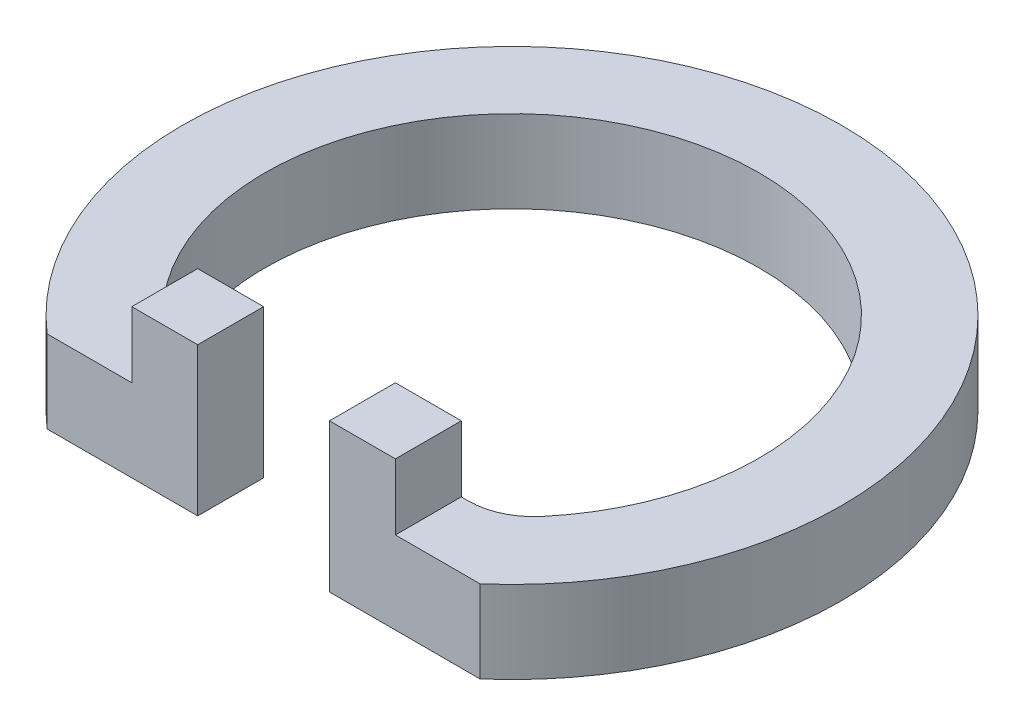
ISO-10303-21;
HEADER;
FILE_DESCRIPTION(('STEP AP214'),'2;1');
FILE_NAME('part.step','',(''),(''),'','','');
FILE_SCHEMA(('AUTOMOTIVE_DESIGN { 1 0 10303 214 1 1 1 1 }'));
ENDSEC;
DATA;
#1=APPLICATION_CONTEXT('core data for automotive mechanical design processes');
#2=APPLICATION_PROTOCOL_DEFINITION('international standard','automotive_design',2000,#1);
#3=PRODUCT_CONTEXT('',#1,'mechanical');
#4=PRODUCT('Part','Part','',(#3));
#5=PRODUCT_RELATED_PRODUCT_CATEGORY('part','',(#4));
#6=PRODUCT_DEFINITION_FORMATION('','',#4);
#7=PRODUCT_DEFINITION_CONTEXT('part definition',#1,'design');
#8=PRODUCT_DEFINITION('design','',#6,#7);
#9=PRODUCT_DEFINITION_SHAPE('','',#8);
#10=(LENGTH_UNIT() NAMED_UNIT(*) SI_UNIT(.MILLI.,.METRE.));
#11=(NAMED_UNIT(*) PLANE_ANGLE_UNIT() SI_UNIT($,.RADIAN.));
#12=(NAMED_UNIT(*) SI_UNIT($,.STERADIAN.) SOLID_ANGLE_UNIT());
#13=UNCERTAINTY_MEASURE_WITH_UNIT(LENGTH_MEASURE(1.E-05),#10,'distance_accuracy_value','');
#14=(GEOMETRIC_REPRESENTATION_CONTEXT(3) GLOBAL_UNCERTAINTY_ASSIGNED_CONTEXT((#13)) GLOBAL_UNIT_ASSIGNED_CONTEXT((#10,
#11,#12)) REPRESENTATION_CONTEXT('',''));
#15=CARTESIAN_POINT('',(0.,0.,0.));
#16=DIRECTION('',(0.,0.,1.));
#17=DIRECTION('',(1.,0.,0.));
#18=AXIS2_PLACEMENT_3D('',#15,#16,#17);
#19=CARTESIAN_POINT('',(0.,12.7,0.));
#20=DIRECTION('',(0.,1.,0.));
#21=DIRECTION('',(0.,0.,1.));
#22=AXIS2_PLACEMENT_3D('',#19,#20,#21);
#23=PLANE('',#22);
#24=DIRECTION('',(1.,0.,0.));
#25=VECTOR('',#24,1.);
#26=CARTESIAN_POINT('',(25.6892064111097,12.7,28.1367139866652));
#27=LINE('',#26,#25);
#28=CARTESIAN_POINT('',(20.32,12.7,28.1367139866652));
#29=VERTEX_POINT('',#28);
#30=CARTESIAN_POINT('',(21.3888137642468,12.7,28.1367139866652));
#31=VERTEX_POINT('',#30);
#32=EDGE_CURVE('E185',#29,#31,#27,.T.);
#33=ORIENTED_EDGE('',*,*,#32,.F.);
#34=DIRECTION('',(0.,0.,-1.));
#35=VECTOR('',#34,1.);
#36=CARTESIAN_POINT('',(20.32,12.7,28.1367139866652));
#37=LINE('',#36,#35);
#38=CARTESIAN_POINT('',(20.32,12.7,38.2967139866652));
#39=VERTEX_POINT('',#38);
#40=EDGE_CURVE('E148',#39,#29,#37,.T.);
#41=ORIENTED_EDGE('',*,*,#40,.F.);
#42=DIRECTION('',(-1.,0.,0.));
#43=VECTOR('',#42,1.);
#44=CARTESIAN_POINT('',(10.16,12.7,38.2967139866652));
#45=LINE('',#44,#43);
#46=CARTESIAN_POINT('',(33.3766639708579,12.7,38.2967139866652));
#47=VERTEX_POINT('',#46);
#48=EDGE_CURVE('E207',#47,#39,#45,.T.);
#49=ORIENTED_EDGE('',*,*,#48,.F.);
#50=CARTESIAN_POINT('',(0.,12.7,0.));
#51=DIRECTION('',(0.,1.,0.));
#52=DIRECTION('',(0.,0.,1.));
#53=AXIS2_PLACEMENT_3D('',#50,#51,#52);
#54=CIRCLE('',#53,50.8);
#55=CARTESIAN_POINT('',(-33.3766639708579,12.7,38.2967139866652));
#56=VERTEX_POINT('',#55);
#57=EDGE_CURVE('E223',#47,#56,#54,.T.);
#58=ORIENTED_EDGE('',*,*,#57,.T.);
#59=DIRECTION('',(-1.,0.,0.));
#60=VECTOR('',#59,1.);
#61=CARTESIAN_POINT('',(-10.16,12.7,38.2967139866652));
#62=LINE('',#61,#60);
#63=CARTESIAN_POINT('',(-20.32,12.7,38.2967139866652));
#64=VERTEX_POINT('',#63);
#65=EDGE_CURVE('E205',#64,#56,#62,.T.);
#66=ORIENTED_EDGE('',*,*,#65,.F.);
#67=DIRECTION('',(0.,0.,-1.));
#68=VECTOR('',#67,1.);
#69=CARTESIAN_POINT('',(-20.32,12.7,28.1367139866652));
#70=LINE('',#69,#68);
#71=CARTESIAN_POINT('',(-20.32,12.7,28.1367139866652));
#72=VERTEX_POINT('',#71);
#73=EDGE_CURVE('E160',#64,#72,#70,.T.);
#74=ORIENTED_EDGE('',*,*,#73,.T.);
#75=DIRECTION('',(1.,0.,0.));
#76=VECTOR('',#75,1.);
#77=CARTESIAN_POINT('',(-25.6892064111097,12.7,28.1367139866652));
#78=LINE('',#77,#76);
#79=CARTESIAN_POINT('',(-21.3888137642468,12.7,28.1367139866652));
#80=VERTEX_POINT('',#79);
#81=EDGE_CURVE('E203',#80,#72,#78,.T.);
#82=ORIENTED_EDGE('',*,*,#81,.F.);
#83=CARTESIAN_POINT('',(-21.3888137642468,12.7,17.9767139866652));
#84=DIRECTION('',(0.,1.,0.));
#85=DIRECTION('',(0.,0.,1.));
#86=AXIS2_PLACEMENT_3D('',#83,#84,#85);
#87=CIRCLE('',#86,10.16);
#88=CARTESIAN_POINT('',(-29.166564223973,12.7,24.5137008909071));
#89=VERTEX_POINT('',#88);
#90=EDGE_CURVE('E234',#80,#89,#87,.F.);
#91=ORIENTED_EDGE('',*,*,#90,.T.);
#92=CARTESIAN_POINT('',(0.,12.7,0.));
#93=DIRECTION('',(0.,1.,0.));
#94=DIRECTION('',(0.,0.,-1.));
#95=AXIS2_PLACEMENT_3D('',#92,#93,#94);
#96=CIRCLE('',#95,38.1);
#97=CARTESIAN_POINT('',(29.166564223973,12.7,24.5137008909071));
#98=VERTEX_POINT('',#97);
#99=EDGE_CURVE('E180',#98,#89,#96,.T.);
#100=ORIENTED_EDGE('',*,*,#99,.F.);
#101=CARTESIAN_POINT('',(21.3888137642468,12.7,17.9767139866652));
#102=DIRECTION('',(0.,1.,0.));
#103=DIRECTION('',(0.,0.,1.));
#104=AXIS2_PLACEMENT_3D('',#101,#102,#103);
#105=CIRCLE('',#104,10.16);
#106=EDGE_CURVE('E40',#98,#31,#105,.F.);
#107=ORIENTED_EDGE('',*,*,#106,.T.);
#108=EDGE_LOOP('',(#33,#41,#49,#58,#66,#74,#82,#91,#100,#107));
#109=FACE_BOUND('',#108,.T.);
#110=ADVANCED_FACE('F32',(#109),#23,.T.);
#111=CARTESIAN_POINT('',(0.,12.7,0.));
#112=DIRECTION('',(0.,-1.,0.));
#113=DIRECTION('',(0.,0.,-1.));
#114=AXIS2_PLACEMENT_3D('',#111,#112,#113);
#115=CYLINDRICAL_SURFACE('',#114,50.8);
#116=ORIENTED_EDGE('',*,*,#57,.F.);
#117=DIRECTION('',(0.,1.,0.));
#118=VECTOR('',#117,1.);
#119=CARTESIAN_POINT('',(33.3766639708579,0.,38.2967139866652));
#120=LINE('',#119,#118);
#121=CARTESIAN_POINT('',(33.3766639708579,0.,38.2967139866652));
#122=VERTEX_POINT('',#121);
#123=EDGE_CURVE('E215',#122,#47,#120,.T.);
#124=ORIENTED_EDGE('',*,*,#123,.F.);
#125=CARTESIAN_POINT('',(0.,0.,0.));
#126=DIRECTION('',(0.,1.,0.));
#127=DIRECTION('',(0.,0.,1.));
#128=AXIS2_PLACEMENT_3D('',#125,#126,#127);
#129=CIRCLE('',#128,50.8);
#130=CARTESIAN_POINT('',(-33.3766639708579,0.,38.2967139866652));
#131=VERTEX_POINT('',#130);
#132=EDGE_CURVE('E212',#122,#131,#129,.T.);
#133=ORIENTED_EDGE('',*,*,#132,.T.);
#134=DIRECTION('',(0.,1.,0.));
#135=VECTOR('',#134,1.);
#136=CARTESIAN_POINT('',(-33.3766639708579,0.,38.2967139866652));
#137=LINE('',#136,#135);
#138=EDGE_CURVE('E217',#131,#56,#137,.T.);
#139=ORIENTED_EDGE('',*,*,#138,.T.);
#140=EDGE_LOOP('',(#116,#124,#133,#139));
#141=FACE_BOUND('',#140,.T.);
#142=ADVANCED_FACE('F277',(#141),#115,.T.);
#143=CARTESIAN_POINT('',(0.,0.,0.));
#144=DIRECTION('',(0.,1.,0.));
#145=DIRECTION('',(0.,0.,1.));
#146=AXIS2_PLACEMENT_3D('',#143,#144,#145);
#147=PLANE('',#146);
#148=ORIENTED_EDGE('',*,*,#132,.F.);
#149=DIRECTION('',(-1.,0.,0.));
#150=VECTOR('',#149,1.);
#151=CARTESIAN_POINT('',(10.16,0.,38.2967139866652));
#152=LINE('',#151,#150);
#153=CARTESIAN_POINT('',(10.16,0.,38.2967139866652));
#154=VERTEX_POINT('',#153);
#155=EDGE_CURVE('E193',#122,#154,#152,.T.);
#156=ORIENTED_EDGE('',*,*,#155,.T.);
#157=DIRECTION('',(0.,0.,-1.));
#158=VECTOR('',#157,1.);
#159=CARTESIAN_POINT('',(10.16,0.,28.1367139866652));
#160=LINE('',#159,#158);
#161=CARTESIAN_POINT('',(10.16,0.,28.1367139866652));
#162=VERTEX_POINT('',#161);
#163=EDGE_CURVE('E196',#154,#162,#160,.T.);
#164=ORIENTED_EDGE('',*,*,#163,.T.);
#165=DIRECTION('',(1.,0.,0.));
#166=VECTOR('',#165,1.);
#167=CARTESIAN_POINT('',(25.6892064111097,0.,28.1367139866652));
#168=LINE('',#167,#166);
#169=CARTESIAN_POINT('',(21.3888137642468,0.,28.1367139866652));
#170=VERTEX_POINT('',#169);
#171=EDGE_CURVE('E199',#162,#170,#168,.T.);
#172=ORIENTED_EDGE('',*,*,#171,.T.);
#173=CARTESIAN_POINT('',(21.3888137642468,0.,17.9767139866652));
#174=DIRECTION('',(0.,1.,0.));
#175=DIRECTION('',(0.,0.,1.));
#176=AXIS2_PLACEMENT_3D('',#173,#174,#175);
#177=CIRCLE('',#176,10.16);
#178=CARTESIAN_POINT('',(29.166564223973,0.,24.5137008909071));
#179=VERTEX_POINT('',#178);
#180=EDGE_CURVE('E11',#170,#179,#177,.T.);
#181=ORIENTED_EDGE('',*,*,#180,.T.);
#182=CARTESIAN_POINT('',(0.,0.,0.));
#183=DIRECTION('',(0.,1.,0.));
#184=DIRECTION('',(0.,0.,-1.));
#185=AXIS2_PLACEMENT_3D('',#182,#183,#184);
#186=CIRCLE('',#185,38.1);
#187=CARTESIAN_POINT('',(-29.166564223973,0.,24.5137008909071));
#188=VERTEX_POINT('',#187);
#189=EDGE_CURVE('E182',#179,#188,#186,.T.);
#190=ORIENTED_EDGE('',*,*,#189,.T.);
#191=CARTESIAN_POINT('',(-21.3888137642468,0.,17.9767139866652));
#192=DIRECTION('',(0.,1.,0.));
#193=DIRECTION('',(0.,0.,1.));
#194=AXIS2_PLACEMENT_3D('',#191,#192,#193);
#195=CIRCLE('',#194,10.16);
#196=CARTESIAN_POINT('',(-21.3888137642468,0.,28.1367139866652));
#197=VERTEX_POINT('',#196);
#198=EDGE_CURVE('E237',#188,#197,#195,.T.);
#199=ORIENTED_EDGE('',*,*,#198,.T.);
#200=DIRECTION('',(1.,0.,0.));
#201=VECTOR('',#200,1.);
#202=CARTESIAN_POINT('',(-25.6892064111097,0.,28.1367139866652));
#203=LINE('',#202,#201);
#204=CARTESIAN_POINT('',(-10.16,0.,28.1367139866652));
#205=VERTEX_POINT('',#204);
#206=EDGE_CURVE('E184',#197,#205,#203,.T.);
#207=ORIENTED_EDGE('',*,*,#206,.T.);
#208=DIRECTION('',(0.,0.,1.));
#209=VECTOR('',#208,1.);
#210=CARTESIAN_POINT('',(-10.16,0.,28.1367139866652));
#211=LINE('',#210,#209);
#212=CARTESIAN_POINT('',(-10.16,0.,38.2967139866652));
#213=VERTEX_POINT('',#212);
#214=EDGE_CURVE('E187',#205,#213,#211,.T.);
#215=ORIENTED_EDGE('',*,*,#214,.T.);
#216=DIRECTION('',(-1.,0.,0.));
#217=VECTOR('',#216,1.);
#218=CARTESIAN_POINT('',(-10.16,0.,38.2967139866652));
#219=LINE('',#218,#217);
#220=EDGE_CURVE('E190',#213,#131,#219,.T.);
#221=ORIENTED_EDGE('',*,*,#220,.T.);
#222=EDGE_LOOP('',(#148,#156,#164,#172,#181,#190,#199,#207,#215,#221));
#223=FACE_BOUND('',#222,.T.);
#224=ADVANCED_FACE('F257',(#223),#147,.F.);
#225=CARTESIAN_POINT('',(0.,0.,0.));
#226=DIRECTION('',(0.,1.,0.));
#227=DIRECTION('',(0.,0.,1.));
#228=AXIS2_PLACEMENT_3D('',#225,#226,#227);
#229=CYLINDRICAL_SURFACE('',#228,38.1);
#230=ORIENTED_EDGE('',*,*,#189,.F.);
#231=DIRECTION('',(0.,1.,0.));
#232=VECTOR('',#231,1.);
#233=CARTESIAN_POINT('',(29.166564223973,0.,24.5137008909071));
#234=LINE('',#233,#232);
#235=EDGE_CURVE('E239',#179,#98,#234,.T.);
#236=ORIENTED_EDGE('',*,*,#235,.T.);
#237=ORIENTED_EDGE('',*,*,#99,.T.);
#238=DIRECTION('',(0.,1.,0.));
#239=VECTOR('',#238,1.);
#240=CARTESIAN_POINT('',(-29.166564223973,0.,24.5137008909071));
#241=LINE('',#240,#239);
#242=EDGE_CURVE('E231',#89,#188,#241,.F.);
#243=ORIENTED_EDGE('',*,*,#242,.T.);
#244=EDGE_LOOP('',(#230,#236,#237,#243));
#245=FACE_BOUND('',#244,.T.);
#246=ADVANCED_FACE('F245',(#245),#229,.F.);
#247=CARTESIAN_POINT('',(25.6892064111097,0.,28.1367139866652));
#248=DIRECTION('',(0.,0.,1.));
#249=DIRECTION('',(1.,0.,0.));
#250=AXIS2_PLACEMENT_3D('',#247,#248,#249);
#251=PLANE('',#250);
#252=ORIENTED_EDGE('',*,*,#32,.T.);
#253=DIRECTION('',(0.,-1.,0.));
#254=VECTOR('',#253,1.);
#255=CARTESIAN_POINT('',(21.3888137642468,0.,28.1367139866652));
#256=LINE('',#255,#254);
#257=EDGE_CURVE('E47',#31,#170,#256,.T.);
#258=ORIENTED_EDGE('',*,*,#257,.T.);
#259=ORIENTED_EDGE('',*,*,#171,.F.);
#260=DIRECTION('',(0.,1.,0.));
#261=VECTOR('',#260,1.);
#262=CARTESIAN_POINT('',(10.16,0.,28.1367139866652));
#263=LINE('',#262,#261);
#264=CARTESIAN_POINT('',(10.16,22.86,28.1367139866652));
#265=VERTEX_POINT('',#264);
#266=EDGE_CURVE('E153',#162,#265,#263,.T.);
#267=ORIENTED_EDGE('',*,*,#266,.T.);
#268=DIRECTION('',(-1.,0.,0.));
#269=VECTOR('',#268,1.);
#270=CARTESIAN_POINT('',(20.32,22.86,28.1367139866652));
#271=LINE('',#270,#269);
#272=CARTESIAN_POINT('',(20.32,22.86,28.1367139866652));
#273=VERTEX_POINT('',#272);
#274=EDGE_CURVE('E138',#273,#265,#271,.T.);
#275=ORIENTED_EDGE('',*,*,#274,.F.);
#276=DIRECTION('',(0.,-1.,0.));
#277=VECTOR('',#276,1.);
#278=CARTESIAN_POINT('',(20.32,22.86,28.1367139866652));
#279=LINE('',#278,#277);
#280=EDGE_CURVE('E145',#273,#29,#279,.T.);
#281=ORIENTED_EDGE('',*,*,#280,.T.);
#282=EDGE_LOOP('',(#252,#258,#259,#267,#275,#281));
#283=FACE_BOUND('',#282,.T.);
#284=ADVANCED_FACE('F152',(#283),#251,.F.);
#285=CARTESIAN_POINT('',(10.16,0.,28.1367139866652));
#286=DIRECTION('',(1.,0.,0.));
#287=DIRECTION('',(0.,0.,-1.));
#288=AXIS2_PLACEMENT_3D('',#285,#286,#287);
#289=PLANE('',#288);
#290=DIRECTION('',(0.,1.,0.));
#291=VECTOR('',#290,1.);
#292=CARTESIAN_POINT('',(10.16,0.,38.2967139866652));
#293=LINE('',#292,#291);
#294=CARTESIAN_POINT('',(10.16,22.86,38.2967139866652));
#295=VERTEX_POINT('',#294);
#296=EDGE_CURVE('E213',#154,#295,#293,.T.);
#297=ORIENTED_EDGE('',*,*,#296,.T.);
#298=DIRECTION('',(0.,0.,1.));
#299=VECTOR('',#298,1.);
#300=CARTESIAN_POINT('',(10.16,22.86,28.1367139866652));
#301=LINE('',#300,#299);
#302=EDGE_CURVE('E150',#265,#295,#301,.T.);
#303=ORIENTED_EDGE('',*,*,#302,.F.);
#304=ORIENTED_EDGE('',*,*,#266,.F.);
#305=ORIENTED_EDGE('',*,*,#163,.F.);
#306=EDGE_LOOP('',(#297,#303,#304,#305));
#307=FACE_BOUND('',#306,.T.);
#308=ADVANCED_FACE('F284',(#307),#289,.F.);
#309=CARTESIAN_POINT('',(10.16,0.,38.2967139866652));
#310=DIRECTION('',(0.,0.,-1.));
#311=DIRECTION('',(-1.,0.,0.));
#312=AXIS2_PLACEMENT_3D('',#309,#310,#311);
#313=PLANE('',#312);
#314=ORIENTED_EDGE('',*,*,#48,.T.);
#315=DIRECTION('',(0.,-1.,0.));
#316=VECTOR('',#315,1.);
#317=CARTESIAN_POINT('',(20.32,22.86,38.2967139866652));
#318=LINE('',#317,#316);
#319=CARTESIAN_POINT('',(20.32,22.86,38.2967139866652));
#320=VERTEX_POINT('',#319);
#321=EDGE_CURVE('E149',#320,#39,#318,.T.);
#322=ORIENTED_EDGE('',*,*,#321,.F.);
#323=DIRECTION('',(1.,0.,0.));
#324=VECTOR('',#323,1.);
#325=CARTESIAN_POINT('',(20.32,22.86,38.2967139866652));
#326=LINE('',#325,#324);
#327=EDGE_CURVE('E140',#295,#320,#326,.T.);
#328=ORIENTED_EDGE('',*,*,#327,.F.);
#329=ORIENTED_EDGE('',*,*,#296,.F.);
#330=ORIENTED_EDGE('',*,*,#155,.F.);
#331=ORIENTED_EDGE('',*,*,#123,.T.);
#332=EDGE_LOOP('',(#314,#322,#328,#329,#330,#331));
#333=FACE_BOUND('',#332,.T.);
#334=ADVANCED_FACE('F280',(#333),#313,.F.);
#335=CARTESIAN_POINT('',(-10.16,0.,38.2967139866652));
#336=DIRECTION('',(0.,0.,-1.));
#337=DIRECTION('',(-1.,0.,0.));
#338=AXIS2_PLACEMENT_3D('',#335,#336,#337);
#339=PLANE('',#338);
#340=DIRECTION('',(0.,1.,0.));
#341=VECTOR('',#340,1.);
#342=CARTESIAN_POINT('',(-10.16,0.,38.2967139866652));
#343=LINE('',#342,#341);
#344=CARTESIAN_POINT('',(-10.16,22.86,38.2967139866652));
#345=VERTEX_POINT('',#344);
#346=EDGE_CURVE('E220',#213,#345,#343,.T.);
#347=ORIENTED_EDGE('',*,*,#346,.T.);
#348=DIRECTION('',(-1.,0.,0.));
#349=VECTOR('',#348,1.);
#350=CARTESIAN_POINT('',(-20.32,22.86,38.2967139866652));
#351=LINE('',#350,#349);
#352=CARTESIAN_POINT('',(-20.32,22.86,38.2967139866652));
#353=VERTEX_POINT('',#352);
#354=EDGE_CURVE('E168',#345,#353,#351,.T.);
#355=ORIENTED_EDGE('',*,*,#354,.T.);
#356=DIRECTION('',(0.,-1.,0.));
#357=VECTOR('',#356,1.);
#358=CARTESIAN_POINT('',(-20.32,22.86,38.2967139866652));
#359=LINE('',#358,#357);
#360=EDGE_CURVE('E174',#353,#64,#359,.T.);
#361=ORIENTED_EDGE('',*,*,#360,.T.);
#362=ORIENTED_EDGE('',*,*,#65,.T.);
#363=ORIENTED_EDGE('',*,*,#138,.F.);
#364=ORIENTED_EDGE('',*,*,#220,.F.);
#365=EDGE_LOOP('',(#347,#355,#361,#362,#363,#364));
#366=FACE_BOUND('',#365,.T.);
#367=ADVANCED_FACE('F271',(#366),#339,.F.);
#368=CARTESIAN_POINT('',(-10.16,0.,28.1367139866652));
#369=DIRECTION('',(-1.,0.,0.));
#370=DIRECTION('',(0.,0.,1.));
#371=AXIS2_PLACEMENT_3D('',#368,#369,#370);
#372=PLANE('',#371);
#373=DIRECTION('',(0.,1.,0.));
#374=VECTOR('',#373,1.);
#375=CARTESIAN_POINT('',(-10.16,0.,28.1367139866652));
#376=LINE('',#375,#374);
#377=CARTESIAN_POINT('',(-10.16,22.86,28.1367139866652));
#378=VERTEX_POINT('',#377);
#379=EDGE_CURVE('E201',#205,#378,#376,.T.);
#380=ORIENTED_EDGE('',*,*,#379,.T.);
#381=DIRECTION('',(0.,0.,1.));
#382=VECTOR('',#381,1.);
#383=CARTESIAN_POINT('',(-10.16,22.86,28.1367139866652));
#384=LINE('',#383,#382);
#385=EDGE_CURVE('E165',#378,#345,#384,.T.);
#386=ORIENTED_EDGE('',*,*,#385,.T.);
#387=ORIENTED_EDGE('',*,*,#346,.F.);
#388=ORIENTED_EDGE('',*,*,#214,.F.);
#389=EDGE_LOOP('',(#380,#386,#387,#388));
#390=FACE_BOUND('',#389,.T.);
#391=ADVANCED_FACE('F265',(#390),#372,.F.);
#392=CARTESIAN_POINT('',(-25.6892064111097,0.,28.1367139866652));
#393=DIRECTION('',(0.,0.,1.));
#394=DIRECTION('',(1.,0.,0.));
#395=AXIS2_PLACEMENT_3D('',#392,#393,#394);
#396=PLANE('',#395);
#397=ORIENTED_EDGE('',*,*,#206,.F.);
#398=DIRECTION('',(0.,-1.,0.));
#399=VECTOR('',#398,1.);
#400=CARTESIAN_POINT('',(-21.3888137642468,12.7,28.1367139866652));
#401=LINE('',#400,#399);
#402=EDGE_CURVE('E226',#197,#80,#401,.F.);
#403=ORIENTED_EDGE('',*,*,#402,.T.);
#404=ORIENTED_EDGE('',*,*,#81,.T.);
#405=DIRECTION('',(0.,-1.,0.));
#406=VECTOR('',#405,1.);
#407=CARTESIAN_POINT('',(-20.32,22.86,28.1367139866652));
#408=LINE('',#407,#406);
#409=CARTESIAN_POINT('',(-20.32,22.86,28.1367139866652));
#410=VERTEX_POINT('',#409);
#411=EDGE_CURVE('E177',#410,#72,#408,.T.);
#412=ORIENTED_EDGE('',*,*,#411,.F.);
#413=DIRECTION('',(1.,0.,0.));
#414=VECTOR('',#413,1.);
#415=CARTESIAN_POINT('',(-20.32,22.86,28.1367139866652));
#416=LINE('',#415,#414);
#417=EDGE_CURVE('E162',#410,#378,#416,.T.);
#418=ORIENTED_EDGE('',*,*,#417,.T.);
#419=ORIENTED_EDGE('',*,*,#379,.F.);
#420=EDGE_LOOP('',(#397,#403,#404,#412,#418,#419));
#421=FACE_BOUND('',#420,.T.);
#422=ADVANCED_FACE('F261',(#421),#396,.F.);
#423=CARTESIAN_POINT('',(-20.32,22.86,28.1367139866652));
#424=DIRECTION('',(-1.,0.,0.));
#425=DIRECTION('',(0.,0.,1.));
#426=AXIS2_PLACEMENT_3D('',#423,#424,#425);
#427=PLANE('',#426);
#428=ORIENTED_EDGE('',*,*,#73,.F.);
#429=ORIENTED_EDGE('',*,*,#360,.F.);
#430=DIRECTION('',(0.,0.,-1.));
#431=VECTOR('',#430,1.);
#432=CARTESIAN_POINT('',(-20.32,22.86,28.1367139866652));
#433=LINE('',#432,#431);
#434=EDGE_CURVE('E171',#353,#410,#433,.T.);
#435=ORIENTED_EDGE('',*,*,#434,.T.);
#436=ORIENTED_EDGE('',*,*,#411,.T.);
#437=EDGE_LOOP('',(#428,#429,#435,#436));
#438=FACE_BOUND('',#437,.T.);
#439=ADVANCED_FACE('F309',(#438),#427,.T.);
#440=CARTESIAN_POINT('',(0.,22.86,0.));
#441=DIRECTION('',(0.,-1.,0.));
#442=DIRECTION('',(0.,0.,-1.));
#443=AXIS2_PLACEMENT_3D('',#440,#441,#442);
#444=PLANE('',#443);
#445=ORIENTED_EDGE('',*,*,#417,.F.);
#446=ORIENTED_EDGE('',*,*,#434,.F.);
#447=ORIENTED_EDGE('',*,*,#354,.F.);
#448=ORIENTED_EDGE('',*,*,#385,.F.);
#449=EDGE_LOOP('',(#445,#446,#447,#448));
#450=FACE_BOUND('',#449,.T.);
#451=ADVANCED_FACE('F268',(#450),#444,.F.);
#452=CARTESIAN_POINT('',(-21.3888137642468,0.,17.9767139866652));
#453=DIRECTION('',(0.,1.,0.));
#454=DIRECTION('',(0.,0.,1.));
#455=AXIS2_PLACEMENT_3D('',#452,#453,#454);
#456=CYLINDRICAL_SURFACE('',#455,10.16);
#457=ORIENTED_EDGE('',*,*,#198,.F.);
#458=ORIENTED_EDGE('',*,*,#242,.F.);
#459=ORIENTED_EDGE('',*,*,#90,.F.);
#460=ORIENTED_EDGE('',*,*,#402,.F.);
#461=EDGE_LOOP('',(#457,#458,#459,#460));
#462=FACE_BOUND('',#461,.T.);
#463=ADVANCED_FACE('F253',(#462),#456,.F.);
#464=CARTESIAN_POINT('',(20.32,22.86,28.1367139866652));
#465=DIRECTION('',(-1.,0.,0.));
#466=DIRECTION('',(0.,0.,1.));
#467=AXIS2_PLACEMENT_3D('',#464,#465,#466);
#468=PLANE('',#467);
#469=ORIENTED_EDGE('',*,*,#40,.T.);
#470=ORIENTED_EDGE('',*,*,#280,.F.);
#471=DIRECTION('',(0.,0.,-1.));
#472=VECTOR('',#471,1.);
#473=CARTESIAN_POINT('',(20.32,22.86,28.1367139866652));
#474=LINE('',#473,#472);
#475=EDGE_CURVE('E133',#320,#273,#474,.T.);
#476=ORIENTED_EDGE('',*,*,#475,.F.);
#477=ORIENTED_EDGE('',*,*,#321,.T.);
#478=EDGE_LOOP('',(#469,#470,#476,#477));
#479=FACE_BOUND('',#478,.T.);
#480=ADVANCED_FACE('F146',(#479),#468,.F.);
#481=CARTESIAN_POINT('',(0.,22.86,0.));
#482=DIRECTION('',(0.,-1.,0.));
#483=DIRECTION('',(0.,0.,-1.));
#484=AXIS2_PLACEMENT_3D('',#481,#482,#483);
#485=PLANE('',#484);
#486=ORIENTED_EDGE('',*,*,#274,.T.);
#487=ORIENTED_EDGE('',*,*,#302,.T.);
#488=ORIENTED_EDGE('',*,*,#327,.T.);
#489=ORIENTED_EDGE('',*,*,#475,.T.);
#490=EDGE_LOOP('',(#486,#487,#488,#489));
#491=FACE_BOUND('',#490,.T.);
#492=ADVANCED_FACE('F135',(#491),#485,.F.);
#493=CARTESIAN_POINT('',(21.3888137642468,0.,17.9767139866652));
#494=DIRECTION('',(0.,1.,0.));
#495=DIRECTION('',(0.,0.,1.));
#496=AXIS2_PLACEMENT_3D('',#493,#494,#495);
#497=CYLINDRICAL_SURFACE('',#496,10.16);
#498=ORIENTED_EDGE('',*,*,#180,.F.);
#499=ORIENTED_EDGE('',*,*,#257,.F.);
#500=ORIENTED_EDGE('',*,*,#106,.F.);
#501=ORIENTED_EDGE('',*,*,#235,.F.);
#502=EDGE_LOOP('',(#498,#499,#500,#501));
#503=FACE_BOUND('',#502,.T.);
#504=ADVANCED_FACE('F34',(#503),#497,.F.);
#505=CLOSED_SHELL('',(#110,#142,#224,#246,#284,#308,#334,#367,#391,#422,#439,#451,#463,#480,
#492,#504));
#506=MANIFOLD_SOLID_BREP('B2',#505);
#507=ADVANCED_BREP_SHAPE_REPRESENTATION('',(#18,#506),#14);
#508=SHAPE_DEFINITION_REPRESENTATION(#9,#507);
ENDSEC;
END-ISO-10303-21;
